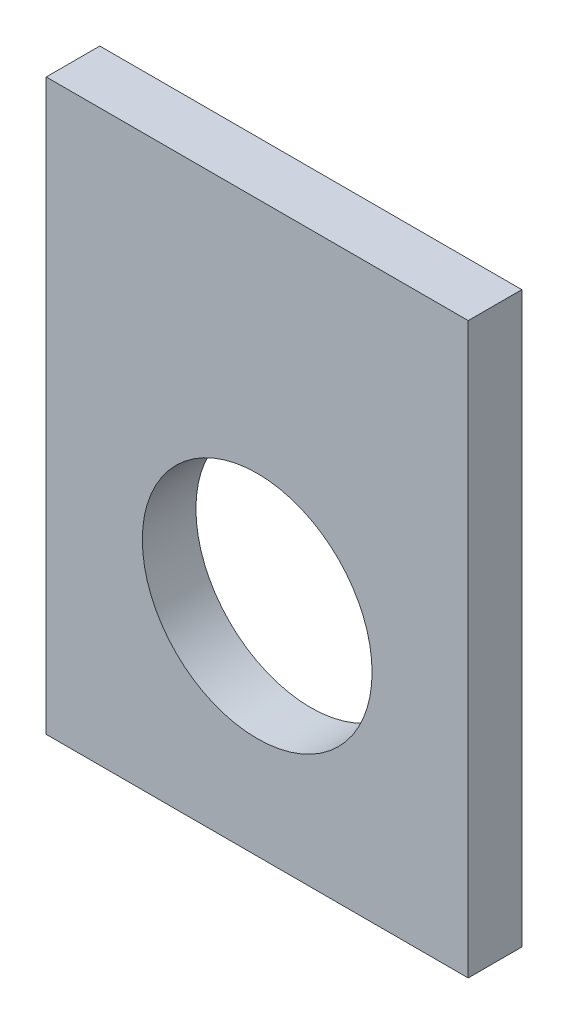
ISO-10303-21;
HEADER;
FILE_DESCRIPTION(('STEP AP214'),'2;1');
FILE_NAME('part.step','',(''),(''),'','','');
FILE_SCHEMA(('AUTOMOTIVE_DESIGN { 1 0 10303 214 1 1 1 1 }'));
ENDSEC;
DATA;
#1=APPLICATION_CONTEXT('core data for automotive mechanical design processes');
#2=APPLICATION_PROTOCOL_DEFINITION('international standard','automotive_design',2000,#1);
#3=PRODUCT_CONTEXT('',#1,'mechanical');
#4=PRODUCT('Part','Part','',(#3));
#5=PRODUCT_RELATED_PRODUCT_CATEGORY('part','',(#4));
#6=PRODUCT_DEFINITION_FORMATION('','',#4);
#7=PRODUCT_DEFINITION_CONTEXT('part definition',#1,'design');
#8=PRODUCT_DEFINITION('design','',#6,#7);
#9=PRODUCT_DEFINITION_SHAPE('','',#8);
#10=(LENGTH_UNIT() NAMED_UNIT(*) SI_UNIT(.MILLI.,.METRE.));
#11=(NAMED_UNIT(*) PLANE_ANGLE_UNIT() SI_UNIT($,.RADIAN.));
#12=(NAMED_UNIT(*) SI_UNIT($,.STERADIAN.) SOLID_ANGLE_UNIT());
#13=UNCERTAINTY_MEASURE_WITH_UNIT(LENGTH_MEASURE(1.E-05),#10,'distance_accuracy_value','');
#14=(GEOMETRIC_REPRESENTATION_CONTEXT(3) GLOBAL_UNCERTAINTY_ASSIGNED_CONTEXT((#13)) GLOBAL_UNIT_ASSIGNED_CONTEXT((#10,
#11,#12)) REPRESENTATION_CONTEXT('',''));
#15=CARTESIAN_POINT('',(0.,0.,0.));
#16=DIRECTION('',(0.,0.,1.));
#17=DIRECTION('',(1.,0.,0.));
#18=AXIS2_PLACEMENT_3D('',#15,#16,#17);
#19=CARTESIAN_POINT('',(12.6,17.,3.2));
#20=DIRECTION('',(-1.,0.,0.));
#21=DIRECTION('',(0.,-1.,0.));
#22=AXIS2_PLACEMENT_3D('',#19,#20,#21);
#23=PLANE('',#22);
#24=DIRECTION('',(0.,1.,0.));
#25=VECTOR('',#24,1.);
#26=CARTESIAN_POINT('',(12.6,17.,0.));
#27=LINE('',#26,#25);
#28=CARTESIAN_POINT('',(12.6,-17.,0.));
#29=VERTEX_POINT('',#28);
#30=CARTESIAN_POINT('',(12.6,17.,0.));
#31=VERTEX_POINT('',#30);
#32=EDGE_CURVE('E96',#29,#31,#27,.T.);
#33=ORIENTED_EDGE('',*,*,#32,.T.);
#34=DIRECTION('',(0.,0.,-1.));
#35=VECTOR('',#34,1.);
#36=CARTESIAN_POINT('',(12.6,17.,3.2));
#37=LINE('',#36,#35);
#38=CARTESIAN_POINT('',(12.6,17.,3.2));
#39=VERTEX_POINT('',#38);
#40=EDGE_CURVE('E11',#39,#31,#37,.T.);
#41=ORIENTED_EDGE('',*,*,#40,.F.);
#42=DIRECTION('',(0.,1.,0.));
#43=VECTOR('',#42,1.);
#44=CARTESIAN_POINT('',(12.6,17.,3.2));
#45=LINE('',#44,#43);
#46=CARTESIAN_POINT('',(12.6,-17.,3.2));
#47=VERTEX_POINT('',#46);
#48=EDGE_CURVE('E84',#47,#39,#45,.T.);
#49=ORIENTED_EDGE('',*,*,#48,.F.);
#50=DIRECTION('',(0.,0.,-1.));
#51=VECTOR('',#50,1.);
#52=CARTESIAN_POINT('',(12.6,-17.,3.2));
#53=LINE('',#52,#51);
#54=EDGE_CURVE('E92',#47,#29,#53,.T.);
#55=ORIENTED_EDGE('',*,*,#54,.T.);
#56=EDGE_LOOP('',(#33,#41,#49,#55));
#57=FACE_BOUND('',#56,.T.);
#58=ADVANCED_FACE('F33',(#57),#23,.F.);
#59=CARTESIAN_POINT('',(-12.6,17.,3.2));
#60=DIRECTION('',(0.,-1.,0.));
#61=DIRECTION('',(0.,0.,-1.));
#62=AXIS2_PLACEMENT_3D('',#59,#60,#61);
#63=PLANE('',#62);
#64=DIRECTION('',(-1.,0.,0.));
#65=VECTOR('',#64,1.);
#66=CARTESIAN_POINT('',(-12.6,17.,0.));
#67=LINE('',#66,#65);
#68=CARTESIAN_POINT('',(-12.6,17.,0.));
#69=VERTEX_POINT('',#68);
#70=EDGE_CURVE('E88',#31,#69,#67,.T.);
#71=ORIENTED_EDGE('',*,*,#70,.T.);
#72=DIRECTION('',(0.,0.,-1.));
#73=VECTOR('',#72,1.);
#74=CARTESIAN_POINT('',(-12.6,17.,3.2));
#75=LINE('',#74,#73);
#76=CARTESIAN_POINT('',(-12.6,17.,3.2));
#77=VERTEX_POINT('',#76);
#78=EDGE_CURVE('E41',#77,#69,#75,.T.);
#79=ORIENTED_EDGE('',*,*,#78,.F.);
#80=DIRECTION('',(-1.,0.,0.));
#81=VECTOR('',#80,1.);
#82=CARTESIAN_POINT('',(-12.6,17.,3.2));
#83=LINE('',#82,#81);
#84=EDGE_CURVE('E79',#39,#77,#83,.T.);
#85=ORIENTED_EDGE('',*,*,#84,.F.);
#86=ORIENTED_EDGE('',*,*,#40,.T.);
#87=EDGE_LOOP('',(#71,#79,#85,#86));
#88=FACE_BOUND('',#87,.T.);
#89=ADVANCED_FACE('F87',(#88),#63,.F.);
#90=CARTESIAN_POINT('',(-12.6,17.,3.2));
#91=DIRECTION('',(1.,0.,0.));
#92=DIRECTION('',(0.,1.,0.));
#93=AXIS2_PLACEMENT_3D('',#90,#91,#92);
#94=PLANE('',#93);
#95=DIRECTION('',(0.,-1.,0.));
#96=VECTOR('',#95,1.);
#97=CARTESIAN_POINT('',(-12.6,17.,0.));
#98=LINE('',#97,#96);
#99=CARTESIAN_POINT('',(-12.6,-17.,0.));
#100=VERTEX_POINT('',#99);
#101=EDGE_CURVE('E66',#69,#100,#98,.T.);
#102=ORIENTED_EDGE('',*,*,#101,.T.);
#103=DIRECTION('',(0.,0.,-1.));
#104=VECTOR('',#103,1.);
#105=CARTESIAN_POINT('',(-12.6,-17.,3.2));
#106=LINE('',#105,#104);
#107=CARTESIAN_POINT('',(-12.6,-17.,3.2));
#108=VERTEX_POINT('',#107);
#109=EDGE_CURVE('E89',#108,#100,#106,.T.);
#110=ORIENTED_EDGE('',*,*,#109,.F.);
#111=DIRECTION('',(0.,-1.,0.));
#112=VECTOR('',#111,1.);
#113=CARTESIAN_POINT('',(-12.6,17.,3.2));
#114=LINE('',#113,#112);
#115=EDGE_CURVE('E82',#77,#108,#114,.T.);
#116=ORIENTED_EDGE('',*,*,#115,.F.);
#117=ORIENTED_EDGE('',*,*,#78,.T.);
#118=EDGE_LOOP('',(#102,#110,#116,#117));
#119=FACE_BOUND('',#118,.T.);
#120=ADVANCED_FACE('F90',(#119),#94,.F.);
#121=CARTESIAN_POINT('',(-12.6,-17.,3.2));
#122=DIRECTION('',(0.,1.,0.));
#123=DIRECTION('',(0.,0.,1.));
#124=AXIS2_PLACEMENT_3D('',#121,#122,#123);
#125=PLANE('',#124);
#126=DIRECTION('',(1.,0.,0.));
#127=VECTOR('',#126,1.);
#128=CARTESIAN_POINT('',(-12.6,-17.,0.));
#129=LINE('',#128,#127);
#130=EDGE_CURVE('E72',#100,#29,#129,.T.);
#131=ORIENTED_EDGE('',*,*,#130,.T.);
#132=ORIENTED_EDGE('',*,*,#54,.F.);
#133=DIRECTION('',(1.,0.,0.));
#134=VECTOR('',#133,1.);
#135=CARTESIAN_POINT('',(-12.6,-17.,3.2));
#136=LINE('',#135,#134);
#137=EDGE_CURVE('E49',#108,#47,#136,.T.);
#138=ORIENTED_EDGE('',*,*,#137,.F.);
#139=ORIENTED_EDGE('',*,*,#109,.T.);
#140=EDGE_LOOP('',(#131,#132,#138,#139));
#141=FACE_BOUND('',#140,.T.);
#142=ADVANCED_FACE('F104',(#141),#125,.F.);
#143=CARTESIAN_POINT('',(0.,0.,3.2));
#144=DIRECTION('',(0.,0.,1.));
#145=DIRECTION('',(1.,0.,0.));
#146=AXIS2_PLACEMENT_3D('',#143,#144,#145);
#147=PLANE('',#146);
#148=CARTESIAN_POINT('',(0.,-4.06,3.2));
#149=DIRECTION('',(0.,0.,1.));
#150=DIRECTION('',(1.,0.,0.));
#151=AXIS2_PLACEMENT_3D('',#148,#149,#150);
#152=CIRCLE('',#151,6.86);
#153=CARTESIAN_POINT('',(6.86,-4.06,3.2));
#154=VERTEX_POINT('',#153);
#155=EDGE_CURVE('E112',#154,#154,#152,.T.);
#156=ORIENTED_EDGE('',*,*,#155,.F.);
#157=EDGE_LOOP('',(#156));
#158=FACE_BOUND('',#157,.T.);
#159=ORIENTED_EDGE('',*,*,#48,.T.);
#160=ORIENTED_EDGE('',*,*,#84,.T.);
#161=ORIENTED_EDGE('',*,*,#115,.T.);
#162=ORIENTED_EDGE('',*,*,#137,.T.);
#163=EDGE_LOOP('',(#159,#160,#161,#162));
#164=FACE_BOUND('',#163,.T.);
#165=ADVANCED_FACE('F80',(#158,#164),#147,.T.);
#166=CARTESIAN_POINT('',(0.,0.,0.));
#167=DIRECTION('',(0.,0.,1.));
#168=DIRECTION('',(1.,0.,0.));
#169=AXIS2_PLACEMENT_3D('',#166,#167,#168);
#170=PLANE('',#169);
#171=CARTESIAN_POINT('',(0.,-4.06,0.));
#172=DIRECTION('',(0.,0.,1.));
#173=DIRECTION('',(1.,0.,0.));
#174=AXIS2_PLACEMENT_3D('',#171,#172,#173);
#175=CIRCLE('',#174,6.86);
#176=CARTESIAN_POINT('',(6.86,-4.06,0.));
#177=VERTEX_POINT('',#176);
#178=EDGE_CURVE('E99',#177,#177,#175,.F.);
#179=ORIENTED_EDGE('',*,*,#178,.F.);
#180=EDGE_LOOP('',(#179));
#181=FACE_BOUND('',#180,.T.);
#182=ORIENTED_EDGE('',*,*,#32,.F.);
#183=ORIENTED_EDGE('',*,*,#130,.F.);
#184=ORIENTED_EDGE('',*,*,#101,.F.);
#185=ORIENTED_EDGE('',*,*,#70,.F.);
#186=EDGE_LOOP('',(#182,#183,#184,#185));
#187=FACE_BOUND('',#186,.T.);
#188=ADVANCED_FACE('F107',(#181,#187),#170,.F.);
#189=CARTESIAN_POINT('',(0.,-4.06,-0.00100000000000013));
#190=DIRECTION('',(0.,0.,1.));
#191=DIRECTION('',(1.,0.,0.));
#192=AXIS2_PLACEMENT_3D('',#189,#190,#191);
#193=CYLINDRICAL_SURFACE('',#192,6.86);
#194=ORIENTED_EDGE('',*,*,#155,.T.);
#195=EDGE_LOOP('',(#194));
#196=FACE_BOUND('',#195,.T.);
#197=ORIENTED_EDGE('',*,*,#178,.T.);
#198=EDGE_LOOP('',(#197));
#199=FACE_BOUND('',#198,.T.);
#200=ADVANCED_FACE('F116',(#196,#199),#193,.F.);
#201=CLOSED_SHELL('',(#58,#89,#120,#142,#165,#188,#200));
#202=MANIFOLD_SOLID_BREP('B2',#201);
#203=ADVANCED_BREP_SHAPE_REPRESENTATION('',(#18,#202),#14);
#204=SHAPE_DEFINITION_REPRESENTATION(#9,#203);
ENDSEC;
END-ISO-10303-21;
